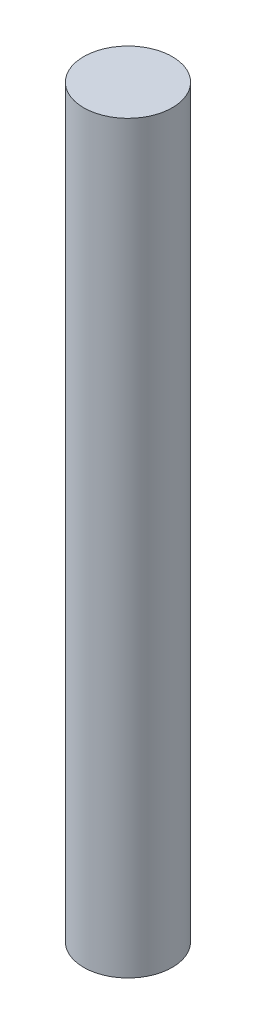
ISO-10303-21;
HEADER;
FILE_DESCRIPTION(('STEP AP214'),'2;1');
FILE_NAME('part.step','',(''),(''),'','','');
FILE_SCHEMA(('AUTOMOTIVE_DESIGN { 1 0 10303 214 1 1 1 1 }'));
ENDSEC;
DATA;
#1=APPLICATION_CONTEXT('core data for automotive mechanical design processes');
#2=APPLICATION_PROTOCOL_DEFINITION('international standard','automotive_design',2000,#1);
#3=PRODUCT_CONTEXT('',#1,'mechanical');
#4=PRODUCT('Part','Part','',(#3));
#5=PRODUCT_RELATED_PRODUCT_CATEGORY('part','',(#4));
#6=PRODUCT_DEFINITION_FORMATION('','',#4);
#7=PRODUCT_DEFINITION_CONTEXT('part definition',#1,'design');
#8=PRODUCT_DEFINITION('design','',#6,#7);
#9=PRODUCT_DEFINITION_SHAPE('','',#8);
#10=(LENGTH_UNIT() NAMED_UNIT(*) SI_UNIT(.MILLI.,.METRE.));
#11=(NAMED_UNIT(*) PLANE_ANGLE_UNIT() SI_UNIT($,.RADIAN.));
#12=(NAMED_UNIT(*) SI_UNIT($,.STERADIAN.) SOLID_ANGLE_UNIT());
#13=UNCERTAINTY_MEASURE_WITH_UNIT(LENGTH_MEASURE(1.E-05),#10,'distance_accuracy_value','');
#14=(GEOMETRIC_REPRESENTATION_CONTEXT(3) GLOBAL_UNCERTAINTY_ASSIGNED_CONTEXT((#13)) GLOBAL_UNIT_ASSIGNED_CONTEXT((#10,
#11,#12)) REPRESENTATION_CONTEXT('',''));
#15=CARTESIAN_POINT('',(0.,0.,0.));
#16=DIRECTION('',(0.,0.,1.));
#17=DIRECTION('',(1.,0.,0.));
#18=AXIS2_PLACEMENT_3D('',#15,#16,#17);
#19=CARTESIAN_POINT('',(0.,40.,0.));
#20=DIRECTION('',(0.,-1.,0.));
#21=DIRECTION('',(0.,0.,-1.));
#22=AXIS2_PLACEMENT_3D('',#19,#20,#21);
#23=CYLINDRICAL_SURFACE('',#22,2.38);
#24=CARTESIAN_POINT('',(0.,40.,0.));
#25=DIRECTION('',(0.,1.,0.));
#26=DIRECTION('',(0.,0.,1.));
#27=AXIS2_PLACEMENT_3D('',#24,#25,#26);
#28=CIRCLE('',#27,2.38);
#29=CARTESIAN_POINT('',(0.,40.,2.38));
#30=VERTEX_POINT('',#29);
#31=EDGE_CURVE('E10',#30,#30,#28,.T.);
#32=ORIENTED_EDGE('',*,*,#31,.F.);
#33=EDGE_LOOP('',(#32));
#34=FACE_BOUND('',#33,.T.);
#35=CARTESIAN_POINT('',(0.,0.,0.));
#36=DIRECTION('',(0.,1.,0.));
#37=DIRECTION('',(0.,0.,1.));
#38=AXIS2_PLACEMENT_3D('',#35,#36,#37);
#39=CIRCLE('',#38,2.38);
#40=CARTESIAN_POINT('',(0.,0.,2.38));
#41=VERTEX_POINT('',#40);
#42=EDGE_CURVE('E34',#41,#41,#39,.T.);
#43=ORIENTED_EDGE('',*,*,#42,.T.);
#44=EDGE_LOOP('',(#43));
#45=FACE_BOUND('',#44,.T.);
#46=ADVANCED_FACE('F31',(#34,#45),#23,.T.);
#47=CARTESIAN_POINT('',(0.,40.,0.));
#48=DIRECTION('',(0.,1.,0.));
#49=DIRECTION('',(0.,0.,1.));
#50=AXIS2_PLACEMENT_3D('',#47,#48,#49);
#51=PLANE('',#50);
#52=ORIENTED_EDGE('',*,*,#31,.T.);
#53=EDGE_LOOP('',(#52));
#54=FACE_BOUND('',#53,.T.);
#55=ADVANCED_FACE('F46',(#54),#51,.T.);
#56=CARTESIAN_POINT('',(0.,0.,0.));
#57=DIRECTION('',(0.,1.,0.));
#58=DIRECTION('',(0.,0.,1.));
#59=AXIS2_PLACEMENT_3D('',#56,#57,#58);
#60=PLANE('',#59);
#61=ORIENTED_EDGE('',*,*,#42,.F.);
#62=EDGE_LOOP('',(#61));
#63=FACE_BOUND('',#62,.T.);
#64=ADVANCED_FACE('F44',(#63),#60,.F.);
#65=CLOSED_SHELL('',(#46,#55,#64));
#66=MANIFOLD_SOLID_BREP('B2',#65);
#67=ADVANCED_BREP_SHAPE_REPRESENTATION('',(#18,#66),#14);
#68=SHAPE_DEFINITION_REPRESENTATION(#9,#67);
ENDSEC;
END-ISO-10303-21;
